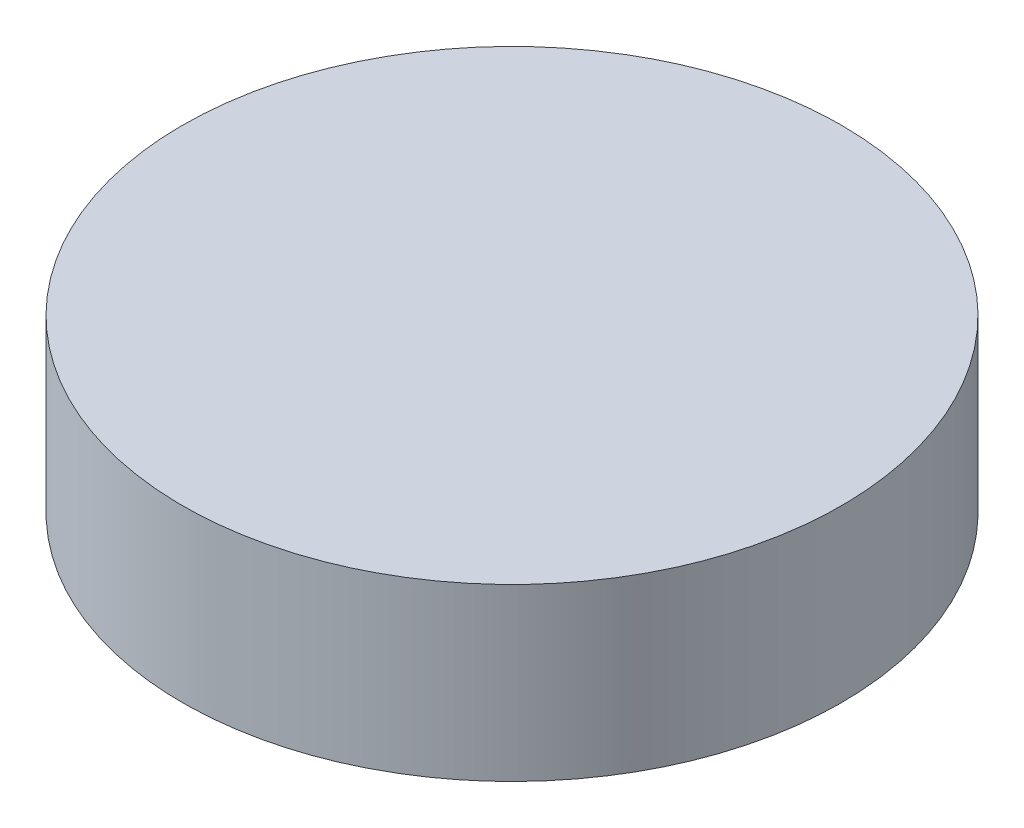
ISO-10303-21;
HEADER;
FILE_DESCRIPTION(('STEP AP214'),'2;1');
FILE_NAME('part.step','',(''),(''),'','','');
FILE_SCHEMA(('AUTOMOTIVE_DESIGN { 1 0 10303 214 1 1 1 1 }'));
ENDSEC;
DATA;
#1=APPLICATION_CONTEXT('core data for automotive mechanical design processes');
#2=APPLICATION_PROTOCOL_DEFINITION('international standard','automotive_design',2000,#1);
#3=PRODUCT_CONTEXT('',#1,'mechanical');
#4=PRODUCT('Part','Part','',(#3));
#5=PRODUCT_RELATED_PRODUCT_CATEGORY('part','',(#4));
#6=PRODUCT_DEFINITION_FORMATION('','',#4);
#7=PRODUCT_DEFINITION_CONTEXT('part definition',#1,'design');
#8=PRODUCT_DEFINITION('design','',#6,#7);
#9=PRODUCT_DEFINITION_SHAPE('','',#8);
#10=(LENGTH_UNIT() NAMED_UNIT(*) SI_UNIT(.MILLI.,.METRE.));
#11=(NAMED_UNIT(*) PLANE_ANGLE_UNIT() SI_UNIT($,.RADIAN.));
#12=(NAMED_UNIT(*) SI_UNIT($,.STERADIAN.) SOLID_ANGLE_UNIT());
#13=UNCERTAINTY_MEASURE_WITH_UNIT(LENGTH_MEASURE(1.E-05),#10,'distance_accuracy_value','');
#14=(GEOMETRIC_REPRESENTATION_CONTEXT(3) GLOBAL_UNCERTAINTY_ASSIGNED_CONTEXT((#13)) GLOBAL_UNIT_ASSIGNED_CONTEXT((#10,
#11,#12)) REPRESENTATION_CONTEXT('',''));
#15=CARTESIAN_POINT('',(0.,0.,0.));
#16=DIRECTION('',(0.,0.,1.));
#17=DIRECTION('',(1.,0.,0.));
#18=AXIS2_PLACEMENT_3D('',#15,#16,#17);
#19=CARTESIAN_POINT('',(-12.5,-12.9333687668426,-1.28535533905933));
#20=CARTESIAN_POINT('',(-12.3317700207924,-12.9333687668426,-1.28535533905933));
#21=CARTESIAN_POINT('',(-11.9953100623771,-12.9333687668426,-1.21842929220248));
#22=CARTESIAN_POINT('',(-11.5674545927316,-12.9333687668426,-0.932545407268426));
#23=CARTESIAN_POINT('',(-11.2815707077975,-12.9333687668426,-0.504689937622919));
#24=CARTESIAN_POINT('',(-11.1811816375122,-12.9333687668426,0.));
#25=CARTESIAN_POINT('',(-11.2815707077975,-12.9333687668426,0.504689937622919));
#26=CARTESIAN_POINT('',(-11.5674545927316,-12.9333687668426,0.932545407268426));
#27=CARTESIAN_POINT('',(-11.9953100623771,-12.9333687668426,1.21842929220248));
#28=CARTESIAN_POINT('',(-12.5,-12.9333687668426,1.31881836248775));
#29=CARTESIAN_POINT('',(-13.0046899376229,-12.9333687668426,1.21842929220248));
#30=CARTESIAN_POINT('',(-13.4325454072684,-12.9333687668426,0.932545407268426));
#31=CARTESIAN_POINT('',(-13.7184292922025,-12.9333687668426,0.50468993762292));
#32=CARTESIAN_POINT('',(-13.8188183624877,-12.9333687668426,0.));
#33=CARTESIAN_POINT('',(-13.7184292922025,-12.9333687668426,-0.504689937622919));
#34=CARTESIAN_POINT('',(-13.4325454072684,-12.9333687668426,-0.932545407268426));
#35=CARTESIAN_POINT('',(-13.0046899376229,-12.9333687668426,-1.21842929220248));
#36=CARTESIAN_POINT('',(-12.6682299792076,-12.9333687668426,-1.28535533905933));
#37=CARTESIAN_POINT('',(-12.5,-12.9333687668426,-1.28535533905933));
#38=B_SPLINE_CURVE_WITH_KNOTS('',3,(#19,#20,#21,#22,#23,#24,#25,#26,#27,#28,#29,#30,#31,#32,#33,
#34,#35,#36,#37),.UNSPECIFIED.,.T.,.F.,(4,1,1,1,1,1,1,1,1,1,1,1,1,1,1,1,4),(0.,
0.0625000000000001,0.125,0.1875,0.25,0.3125,0.375,0.4375,0.5,0.5625,0.625,0.6875,0.75,0.8125,
0.875,0.9375,1.),.UNSPECIFIED.);
#39=DIRECTION('',(0.,-1.,0.));
#40=VECTOR('',#39,1.);
#41=SURFACE_OF_LINEAR_EXTRUSION('',#38,#40);
#42=CARTESIAN_POINT('',(-12.5,-12.9333687668426,-1.28535533905933));
#43=CARTESIAN_POINT('',(-12.3317700207924,-12.9333687668426,-1.28535533905933));
#44=CARTESIAN_POINT('',(-11.9953100623771,-12.9333687668426,-1.21842929220248));
#45=CARTESIAN_POINT('',(-11.5674545927316,-12.9333687668426,-0.932545407268426));
#46=CARTESIAN_POINT('',(-11.2815707077975,-12.9333687668426,-0.504689937622919));
#47=CARTESIAN_POINT('',(-11.1811816375122,-12.9333687668426,0.));
#48=CARTESIAN_POINT('',(-11.2815707077975,-12.9333687668426,0.504689937622919));
#49=CARTESIAN_POINT('',(-11.5674545927316,-12.9333687668426,0.932545407268426));
#50=CARTESIAN_POINT('',(-11.9953100623771,-12.9333687668426,1.21842929220248));
#51=CARTESIAN_POINT('',(-12.5,-12.9333687668426,1.31881836248775));
#52=CARTESIAN_POINT('',(-13.0046899376229,-12.9333687668426,1.21842929220248));
#53=CARTESIAN_POINT('',(-13.4325454072684,-12.9333687668426,0.932545407268426));
#54=CARTESIAN_POINT('',(-13.7184292922025,-12.9333687668426,0.50468993762292));
#55=CARTESIAN_POINT('',(-13.8188183624877,-12.9333687668426,0.));
#56=CARTESIAN_POINT('',(-13.7184292922025,-12.9333687668426,-0.504689937622919));
#57=CARTESIAN_POINT('',(-13.4325454072684,-12.9333687668426,-0.932545407268426));
#58=CARTESIAN_POINT('',(-13.0046899376229,-12.9333687668426,-1.21842929220248));
#59=CARTESIAN_POINT('',(-12.6682299792076,-12.9333687668426,-1.28535533905933));
#60=CARTESIAN_POINT('',(-12.5,-12.9333687668426,-1.28535533905933));
#61=B_SPLINE_CURVE_WITH_KNOTS('',3,(#42,#43,#44,#45,#46,#47,#48,#49,#50,#51,#52,#53,#54,#55,#56,
#57,#58,#59,#60),.UNSPECIFIED.,.T.,.F.,(4,1,1,1,1,1,1,1,1,1,1,1,1,1,1,1,4),(0.,
0.0625000000000001,0.125,0.1875,0.25,0.3125,0.375,0.4375,0.5,0.5625,0.625,0.6875,0.75,0.8125,
0.875,0.9375,1.),.UNSPECIFIED.);
#62=CARTESIAN_POINT('',(-12.5,-12.9333687668426,-1.28535533905933));
#63=VERTEX_POINT('',#62);
#64=EDGE_CURVE('E9',#63,#63,#61,.T.);
#65=ORIENTED_EDGE('',*,*,#64,.T.);
#66=EDGE_LOOP('',(#65));
#67=FACE_BOUND('',#66,.T.);
#68=CARTESIAN_POINT('',(-12.5,-13.599,-1.28535533905933));
#69=CARTESIAN_POINT('',(-12.5210292435893,-13.599,-1.28535535428354));
#70=CARTESIAN_POINT('',(-12.5420580506909,-13.599,-1.2848324564651));
#71=CARTESIAN_POINT('',(-12.5840656469514,-13.599,-1.28275095206051));
#72=CARTESIAN_POINT('',(-12.605044433095,-13.599,-1.28119228454248));
#73=CARTESIAN_POINT('',(-12.6469017924796,-13.599,-1.27704921828212));
#74=CARTESIAN_POINT('',(-12.6677803587443,-13.599,-1.2744647491513));
#75=CARTESIAN_POINT('',(-12.7093873858979,-13.599,-1.26828002178174));
#76=CARTESIAN_POINT('',(-12.7301158402734,-13.599,-1.26467971973334));
#77=CARTESIAN_POINT('',(-12.7713726611837,-13.599,-1.25647322848943));
#78=CARTESIAN_POINT('',(-12.7919010277185,-13.599,-1.25186703929392));
#79=CARTESIAN_POINT('',(-12.832707709252,-13.599,-1.24165865806837));
#80=CARTESIAN_POINT('',(-12.8529860349978,-13.599,-1.23605650900607));
#81=CARTESIAN_POINT('',(-12.8932426430212,-13.599,-1.22386610104828));
#82=CARTESIAN_POINT('',(-12.9132209457939,-13.599,-1.21727790985115));
#83=CARTESIAN_POINT('',(-12.9528275830444,-13.599,-1.20312529881931));
#84=CARTESIAN_POINT('',(-12.9724559380415,-13.599,-1.19556093643833));
#85=CARTESIAN_POINT('',(-13.0113124478785,-13.599,-1.17946604308371));
#86=CARTESIAN_POINT('',(-13.0305406027184,-13.599,-1.17093551211008));
#87=CARTESIAN_POINT('',(-13.06855413176,-13.599,-1.15293679752466));
#88=CARTESIAN_POINT('',(-13.0873394798451,-13.599,-1.14346855877762));
#89=CARTESIAN_POINT('',(-13.1244251203754,-13.599,-1.12362275852903));
#90=CARTESIAN_POINT('',(-13.1427253794428,-13.599,-1.11324513466535));
#91=CARTESIAN_POINT('',(-13.1787984767248,-13.599,-1.09160886850265));
#92=CARTESIAN_POINT('',(-13.1965712921558,-13.599,-1.08035018822159));
#93=CARTESIAN_POINT('',(-13.2315471338735,-13.599,-1.05698007794264));
#94=CARTESIAN_POINT('',(-13.2487501601601,-13.599,-1.04486864794475));
#95=CARTESIAN_POINT('',(-13.2825440403118,-13.599,-1.0198212922901));
#96=CARTESIAN_POINT('',(-13.2991349205488,-13.599,-1.00688540221767));
#97=CARTESIAN_POINT('',(-13.331662109414,-13.599,-0.980217396939715));
#98=CARTESIAN_POINT('',(-13.3475984628843,-13.599,-0.966485336436221));
#99=CARTESIAN_POINT('',(-13.3787742546724,-13.599,-0.938253224868504));
#100=CARTESIAN_POINT('',(-13.3940137339342,-13.599,-0.923753219032213));
#101=CARTESIAN_POINT('',(-13.4237532190322,-13.599,-0.894013733934155));
#102=CARTESIAN_POINT('',(-13.4382532248685,-13.599,-0.878774254672389));
#103=CARTESIAN_POINT('',(-13.4664853364362,-13.599,-0.847598462884291));
#104=CARTESIAN_POINT('',(-13.4802173969397,-13.599,-0.831662109414029));
#105=CARTESIAN_POINT('',(-13.5068854022177,-13.599,-0.799134920548772));
#106=CARTESIAN_POINT('',(-13.5198212922901,-13.599,-0.782544040311809));
#107=CARTESIAN_POINT('',(-13.5448686479447,-13.599,-0.748750160160128));
#108=CARTESIAN_POINT('',(-13.5569800779426,-13.599,-0.731547133873459));
#109=CARTESIAN_POINT('',(-13.5803501882216,-13.599,-0.696571292155848));
#110=CARTESIAN_POINT('',(-13.5916088685027,-13.599,-0.678798476724906));
#111=CARTESIAN_POINT('',(-13.6132451346653,-13.599,-0.642725379442669));
#112=CARTESIAN_POINT('',(-13.623622758529,-13.599,-0.624425120374889));
#113=CARTESIAN_POINT('',(-13.6434685587776,-13.599,-0.587339479845542));
#114=CARTESIAN_POINT('',(-13.6529367975248,-13.599,-0.568554131761774));
#115=CARTESIAN_POINT('',(-13.67093551211,-13.599,-0.530540602716617));
#116=CARTESIAN_POINT('',(-13.6794660430833,-13.599,-0.511312447871825));
#117=CARTESIAN_POINT('',(-13.6955609364387,-13.599,-0.472455938048209));
#118=CARTESIAN_POINT('',(-13.7031252988208,-13.599,-0.452827583069387));
#119=CARTESIAN_POINT('',(-13.7172779098496,-13.599,-0.413220945768882));
#120=CARTESIAN_POINT('',(-13.7238661010426,-13.599,-0.39324264292792));
#121=CARTESIAN_POINT('',(-13.7360565090117,-13.599,-0.352986035091083));
#122=CARTESIAN_POINT('',(-13.7416586580894,-13.599,-0.332707709600189));
#123=CARTESIAN_POINT('',(-13.7518670392729,-13.599,-0.291901027370323));
#124=CARTESIAN_POINT('',(-13.7564732284109,-13.599,-0.271372659884375));
#125=CARTESIAN_POINT('',(-13.7646797198118,-13.599,-0.230115841572818));
#126=CARTESIAN_POINT('',(-13.7682800220747,-13.599,-0.209387390747211));
#127=CARTESIAN_POINT('',(-13.7744647488584,-13.599,-0.167780353895161));
#128=CARTESIAN_POINT('',(-13.7770492171889,-13.599,-0.146901774382847));
#129=CARTESIAN_POINT('',(-13.7811922856357,-13.599,-0.10504445119053));
#130=CARTESIAN_POINT('',(-13.7827509561402,-13.599,-0.0840657144826372));
#131=CARTESIAN_POINT('',(-13.7848324523857,-13.599,-0.0420579831636655));
#132=CARTESIAN_POINT('',(-13.7853553390593,-13.599,-0.0210289915818326));
#133=CARTESIAN_POINT('',(-13.7853553390593,-13.599,0.0210289915818331));
#134=CARTESIAN_POINT('',(-13.7848324523857,-13.599,0.0420579831636659));
#135=CARTESIAN_POINT('',(-13.7827509561402,-13.599,0.0840657144826377));
#136=CARTESIAN_POINT('',(-13.7811922856357,-13.599,0.10504445119053));
#137=CARTESIAN_POINT('',(-13.7770492171889,-13.599,0.146901774382848));
#138=CARTESIAN_POINT('',(-13.7744647488584,-13.599,0.167780353895162));
#139=CARTESIAN_POINT('',(-13.7682800220747,-13.599,0.209387390747211));
#140=CARTESIAN_POINT('',(-13.7646797198118,-13.599,0.230115841572819));
#141=CARTESIAN_POINT('',(-13.7564732284109,-13.599,0.271372659884376));
#142=CARTESIAN_POINT('',(-13.7518670392729,-13.599,0.291901027370324));
#143=CARTESIAN_POINT('',(-13.7416586580894,-13.599,0.33270770960019));
#144=CARTESIAN_POINT('',(-13.7360565090117,-13.599,0.352986035091084));
#145=CARTESIAN_POINT('',(-13.7238661010426,-13.599,0.393242642927921));
#146=CARTESIAN_POINT('',(-13.7172779098496,-13.599,0.413220945768883));
#147=CARTESIAN_POINT('',(-13.7031252988208,-13.599,0.452827583069388));
#148=CARTESIAN_POINT('',(-13.6955609364387,-13.599,0.472455938048211));
#149=CARTESIAN_POINT('',(-13.6794660430833,-13.599,0.511312447871826));
#150=CARTESIAN_POINT('',(-13.67093551211,-13.599,0.530540602716618));
#151=CARTESIAN_POINT('',(-13.6529367975248,-13.599,0.568554131761775));
#152=CARTESIAN_POINT('',(-13.6434685587776,-13.599,0.587339479845544));
#153=CARTESIAN_POINT('',(-13.623622758529,-13.599,0.624425120374891));
#154=CARTESIAN_POINT('',(-13.6132451346653,-13.599,0.64272537944267));
#155=CARTESIAN_POINT('',(-13.5916088685027,-13.599,0.678798476724906));
#156=CARTESIAN_POINT('',(-13.5803501882216,-13.599,0.69657129215585));
#157=CARTESIAN_POINT('',(-13.5569800779426,-13.599,0.731547133873461));
#158=CARTESIAN_POINT('',(-13.5448686479447,-13.599,0.748750160160129));
#159=CARTESIAN_POINT('',(-13.5198212922901,-13.599,0.78254404031181));
#160=CARTESIAN_POINT('',(-13.5068854022177,-13.599,0.799134920548773));
#161=CARTESIAN_POINT('',(-13.4802173969397,-13.599,0.83166210941403));
#162=CARTESIAN_POINT('',(-13.4664853364362,-13.599,0.847598462884291));
#163=CARTESIAN_POINT('',(-13.4382532248685,-13.599,0.87877425467239));
#164=CARTESIAN_POINT('',(-13.4237532190322,-13.599,0.894013733934156));
#165=CARTESIAN_POINT('',(-13.3940137339342,-13.599,0.923753219032213));
#166=CARTESIAN_POINT('',(-13.3787742546724,-13.599,0.938253224868505));
#167=CARTESIAN_POINT('',(-13.3475984628843,-13.599,0.966485336436221));
#168=CARTESIAN_POINT('',(-13.331662109414,-13.599,0.980217396939716));
#169=CARTESIAN_POINT('',(-13.2991349205488,-13.599,1.00688540221767));
#170=CARTESIAN_POINT('',(-13.2825440403118,-13.599,1.0198212922901));
#171=CARTESIAN_POINT('',(-13.2487501601601,-13.599,1.04486864794475));
#172=CARTESIAN_POINT('',(-13.2315471338735,-13.599,1.05698007794264));
#173=CARTESIAN_POINT('',(-13.1965712921558,-13.599,1.08035018822159));
#174=CARTESIAN_POINT('',(-13.1787984767249,-13.599,1.09160886850266));
#175=CARTESIAN_POINT('',(-13.1427253794427,-13.599,1.11324513466535));
#176=CARTESIAN_POINT('',(-13.1244251203749,-13.599,1.12362275852901));
#177=CARTESIAN_POINT('',(-13.0873394798455,-13.599,1.14346855877765));
#178=CARTESIAN_POINT('',(-13.0685541317618,-13.599,1.15293679752477));
#179=CARTESIAN_POINT('',(-13.0305406027166,-13.599,1.17093551210997));
#180=CARTESIAN_POINT('',(-13.0113124478718,-13.599,1.17946604308331));
#181=CARTESIAN_POINT('',(-12.9724559380482,-13.599,1.19556093643873));
#182=CARTESIAN_POINT('',(-12.9528275830694,-13.599,1.20312529882082));
#183=CARTESIAN_POINT('',(-12.9132209457689,-13.599,1.21727790984964));
#184=CARTESIAN_POINT('',(-12.8932426429279,-13.599,1.22386610104265));
#185=CARTESIAN_POINT('',(-12.8529860350911,-13.599,1.23605650901171));
#186=CARTESIAN_POINT('',(-12.8327077096002,-13.599,1.24165865808941));
#187=CARTESIAN_POINT('',(-12.7919010273703,-13.599,1.25186703927288));
#188=CARTESIAN_POINT('',(-12.7713726598844,-13.599,1.25647322841093));
#189=CARTESIAN_POINT('',(-12.7301158415728,-13.599,1.26467971981183));
#190=CARTESIAN_POINT('',(-12.7093873907472,-13.599,1.26828002207469));
#191=CARTESIAN_POINT('',(-12.6677803538952,-13.599,1.27446474885836));
#192=CARTESIAN_POINT('',(-12.6469017743828,-13.599,1.27704921718887));
#193=CARTESIAN_POINT('',(-12.6050444511905,-13.599,1.28119228563567));
#194=CARTESIAN_POINT('',(-12.5840657144826,-13.599,1.28275095614019));
#195=CARTESIAN_POINT('',(-12.5420579831637,-13.599,1.28483245238567));
#196=CARTESIAN_POINT('',(-12.5210289915818,-13.599,1.28535533905933));
#197=CARTESIAN_POINT('',(-12.4789710084182,-13.599,1.28535533905933));
#198=CARTESIAN_POINT('',(-12.4579420168363,-13.599,1.28483245238567));
#199=CARTESIAN_POINT('',(-12.4159342855174,-13.599,1.28275095614019));
#200=CARTESIAN_POINT('',(-12.3949555488095,-13.599,1.28119228563567));
#201=CARTESIAN_POINT('',(-12.3530982256172,-13.599,1.27704921718887));
#202=CARTESIAN_POINT('',(-12.3322196461048,-13.599,1.27446474885836));
#203=CARTESIAN_POINT('',(-12.2906126092528,-13.599,1.26828002207469));
#204=CARTESIAN_POINT('',(-12.2698841584272,-13.599,1.26467971981183));
#205=CARTESIAN_POINT('',(-12.2286273401156,-13.599,1.25647322841093));
#206=CARTESIAN_POINT('',(-12.2080989726297,-13.599,1.25186703927288));
#207=CARTESIAN_POINT('',(-12.1672922903998,-13.599,1.24165865808941));
#208=CARTESIAN_POINT('',(-12.1470139649089,-13.599,1.23605650901171));
#209=CARTESIAN_POINT('',(-12.1067573570721,-13.599,1.22386610104265));
#210=CARTESIAN_POINT('',(-12.0867790542311,-13.599,1.21727790984964));
#211=CARTESIAN_POINT('',(-12.0471724169306,-13.599,1.20312529882082));
#212=CARTESIAN_POINT('',(-12.0275440619518,-13.599,1.19556093643873));
#213=CARTESIAN_POINT('',(-11.9886875521282,-13.599,1.17946604308331));
#214=CARTESIAN_POINT('',(-11.9694593972834,-13.599,1.17093551210997));
#215=CARTESIAN_POINT('',(-11.9314458682382,-13.599,1.15293679752477));
#216=CARTESIAN_POINT('',(-11.9126605201545,-13.599,1.14346855877765));
#217=CARTESIAN_POINT('',(-11.8755748796251,-13.599,1.123622758529));
#218=CARTESIAN_POINT('',(-11.8572746205573,-13.599,1.11324513466535));
#219=CARTESIAN_POINT('',(-11.8212015232751,-13.599,1.09160886850266));
#220=CARTESIAN_POINT('',(-11.8034287078441,-13.599,1.08035018822159));
#221=CARTESIAN_POINT('',(-11.7684528661265,-13.599,1.05698007794264));
#222=CARTESIAN_POINT('',(-11.7512498398399,-13.599,1.04486864794475));
#223=CARTESIAN_POINT('',(-11.7174559596882,-13.599,1.0198212922901));
#224=CARTESIAN_POINT('',(-11.7008650794512,-13.599,1.00688540221767));
#225=CARTESIAN_POINT('',(-11.668337890586,-13.599,0.980217396939715));
#226=CARTESIAN_POINT('',(-11.6524015371157,-13.599,0.966485336436221));
#227=CARTESIAN_POINT('',(-11.6212257453276,-13.599,0.938253224868504));
#228=CARTESIAN_POINT('',(-11.6059862660658,-13.599,0.923753219032213));
#229=CARTESIAN_POINT('',(-11.5762467809678,-13.599,0.894013733934155));
#230=CARTESIAN_POINT('',(-11.5617467751315,-13.599,0.878774254672389));
#231=CARTESIAN_POINT('',(-11.5335146635638,-13.599,0.84759846288429));
#232=CARTESIAN_POINT('',(-11.5197826030603,-13.599,0.831662109414029));
#233=CARTESIAN_POINT('',(-11.4931145977823,-13.599,0.799134920548772));
#234=CARTESIAN_POINT('',(-11.4801787077099,-13.599,0.782544040311809));
#235=CARTESIAN_POINT('',(-11.4551313520553,-13.599,0.748750160160128));
#236=CARTESIAN_POINT('',(-11.4430199220574,-13.599,0.73154713387346));
#237=CARTESIAN_POINT('',(-11.4196498117784,-13.599,0.696571292155849));
#238=CARTESIAN_POINT('',(-11.4083911314973,-13.599,0.678798476724905));
#239=CARTESIAN_POINT('',(-11.3867548653347,-13.599,0.642725379442669));
#240=CARTESIAN_POINT('',(-11.376377241471,-13.599,0.62442512037489));
#241=CARTESIAN_POINT('',(-11.3565314412223,-13.599,0.587339479845543));
#242=CARTESIAN_POINT('',(-11.3470632024752,-13.599,0.568554131761774));
#243=CARTESIAN_POINT('',(-11.32906448789,-13.599,0.530540602716617));
#244=CARTESIAN_POINT('',(-11.3205339569167,-13.599,0.511312447871824));
#245=CARTESIAN_POINT('',(-11.3044390635613,-13.599,0.472455938048209));
#246=CARTESIAN_POINT('',(-11.2968747011792,-13.599,0.452827583069387));
#247=CARTESIAN_POINT('',(-11.2827220901504,-13.599,0.413220945768882));
#248=CARTESIAN_POINT('',(-11.2761338989574,-13.599,0.39324264292792));
#249=CARTESIAN_POINT('',(-11.2639434909883,-13.599,0.352986035091083));
#250=CARTESIAN_POINT('',(-11.2583413419106,-13.599,0.332707709600189));
#251=CARTESIAN_POINT('',(-11.2481329607271,-13.599,0.291901027370323));
#252=CARTESIAN_POINT('',(-11.2435267715891,-13.599,0.271372659884375));
#253=CARTESIAN_POINT('',(-11.2353202801882,-13.599,0.230115841572818));
#254=CARTESIAN_POINT('',(-11.2317199779253,-13.599,0.209387390747211));
#255=CARTESIAN_POINT('',(-11.2255352511416,-13.599,0.167780353895161));
#256=CARTESIAN_POINT('',(-11.2229507828111,-13.599,0.146901774382847));
#257=CARTESIAN_POINT('',(-11.2188077143643,-13.599,0.105044451190529));
#258=CARTESIAN_POINT('',(-11.2172490438598,-13.599,0.0840657144826369));
#259=CARTESIAN_POINT('',(-11.2151675476143,-13.599,0.0420579831636654));
#260=CARTESIAN_POINT('',(-11.2146446609407,-13.599,0.0210289915818325));
#261=CARTESIAN_POINT('',(-11.2146446609407,-13.599,-0.0210289915818333));
#262=CARTESIAN_POINT('',(-11.2151675476143,-13.599,-0.0420579831636662));
#263=CARTESIAN_POINT('',(-11.2172490438598,-13.599,-0.0840657144826378));
#264=CARTESIAN_POINT('',(-11.2188077143643,-13.599,-0.10504445119053));
#265=CARTESIAN_POINT('',(-11.2229507828111,-13.599,-0.146901774382848));
#266=CARTESIAN_POINT('',(-11.2255352511416,-13.599,-0.167780353895162));
#267=CARTESIAN_POINT('',(-11.2317199779253,-13.599,-0.209387390747211));
#268=CARTESIAN_POINT('',(-11.2353202801882,-13.599,-0.230115841572819));
#269=CARTESIAN_POINT('',(-11.2435267715891,-13.599,-0.271372659884375));
#270=CARTESIAN_POINT('',(-11.2481329607271,-13.599,-0.291901027370323));
#271=CARTESIAN_POINT('',(-11.2583413419106,-13.599,-0.33270770960019));
#272=CARTESIAN_POINT('',(-11.2639434909883,-13.599,-0.352986035091083));
#273=CARTESIAN_POINT('',(-11.2761338989574,-13.599,-0.393242642927921));
#274=CARTESIAN_POINT('',(-11.2827220901504,-13.599,-0.413220945768883));
#275=CARTESIAN_POINT('',(-11.2968747011792,-13.599,-0.452827583069388));
#276=CARTESIAN_POINT('',(-11.3044390635613,-13.599,-0.47245593804821));
#277=CARTESIAN_POINT('',(-11.3205339569167,-13.599,-0.511312447871825));
#278=CARTESIAN_POINT('',(-11.32906448789,-13.599,-0.530540602716618));
#279=CARTESIAN_POINT('',(-11.3470632024752,-13.599,-0.568554131761775));
#280=CARTESIAN_POINT('',(-11.3565314412223,-13.599,-0.587339479845543));
#281=CARTESIAN_POINT('',(-11.376377241471,-13.599,-0.62442512037489));
#282=CARTESIAN_POINT('',(-11.3867548653347,-13.599,-0.642725379442669));
#283=CARTESIAN_POINT('',(-11.4083911314973,-13.599,-0.678798476724906));
#284=CARTESIAN_POINT('',(-11.4196498117784,-13.599,-0.696571292155849));
#285=CARTESIAN_POINT('',(-11.4430199220574,-13.599,-0.73154713387346));
#286=CARTESIAN_POINT('',(-11.4551313520553,-13.599,-0.748750160160128));
#287=CARTESIAN_POINT('',(-11.4801787077099,-13.599,-0.782544040311809));
#288=CARTESIAN_POINT('',(-11.4931145977823,-13.599,-0.799134920548772));
#289=CARTESIAN_POINT('',(-11.5197826030603,-13.599,-0.831662109414029));
#290=CARTESIAN_POINT('',(-11.5335146635638,-13.599,-0.847598462884291));
#291=CARTESIAN_POINT('',(-11.5617467751315,-13.599,-0.878774254672389));
#292=CARTESIAN_POINT('',(-11.5762467809678,-13.599,-0.894013733934155));
#293=CARTESIAN_POINT('',(-11.6059862660658,-13.599,-0.923753219032213));
#294=CARTESIAN_POINT('',(-11.6212257453276,-13.599,-0.938253224868505));
#295=CARTESIAN_POINT('',(-11.6524015371157,-13.599,-0.966485336436221));
#296=CARTESIAN_POINT('',(-11.668337890586,-13.599,-0.980217396939716));
#297=CARTESIAN_POINT('',(-11.7008650794512,-13.599,-1.00688540221767));
#298=CARTESIAN_POINT('',(-11.7174559596882,-13.599,-1.0198212922901));
#299=CARTESIAN_POINT('',(-11.7512498398399,-13.599,-1.04486864794475));
#300=CARTESIAN_POINT('',(-11.7684528661265,-13.599,-1.05698007794264));
#301=CARTESIAN_POINT('',(-11.8034287078442,-13.599,-1.08035018822159));
#302=CARTESIAN_POINT('',(-11.8212015232752,-13.599,-1.09160886850265));
#303=CARTESIAN_POINT('',(-11.8572746205572,-13.599,-1.11324513466535));
#304=CARTESIAN_POINT('',(-11.8755748796246,-13.599,-1.12362275852903));
#305=CARTESIAN_POINT('',(-11.9126605201549,-13.599,-1.14346855877762));
#306=CARTESIAN_POINT('',(-11.93144586824,-13.599,-1.15293679752466));
#307=CARTESIAN_POINT('',(-11.9694593972816,-13.599,-1.17093551211008));
#308=CARTESIAN_POINT('',(-11.9886875521215,-13.599,-1.17946604308371));
#309=CARTESIAN_POINT('',(-12.0275440619585,-13.599,-1.19556093643833));
#310=CARTESIAN_POINT('',(-12.0471724169556,-13.599,-1.20312529881931));
#311=CARTESIAN_POINT('',(-12.0867790542061,-13.599,-1.21727790985115));
#312=CARTESIAN_POINT('',(-12.1067573569788,-13.599,-1.22386610104828));
#313=CARTESIAN_POINT('',(-12.1470139650022,-13.599,-1.23605650900607));
#314=CARTESIAN_POINT('',(-12.167292290748,-13.599,-1.24165865806837));
#315=CARTESIAN_POINT('',(-12.2080989722815,-13.599,-1.25186703929392));
#316=CARTESIAN_POINT('',(-12.2286273388163,-13.599,-1.25647322848943));
#317=CARTESIAN_POINT('',(-12.2698841597265,-13.599,-1.26467971973334));
#318=CARTESIAN_POINT('',(-12.2906126141021,-13.599,-1.26828002178174));
#319=CARTESIAN_POINT('',(-12.3322196412557,-13.599,-1.2744647491513));
#320=CARTESIAN_POINT('',(-12.3530982075204,-13.599,-1.27704921828212));
#321=CARTESIAN_POINT('',(-12.394955566905,-13.599,-1.28119228454249));
#322=CARTESIAN_POINT('',(-12.4159343530485,-13.599,-1.28275095206051));
#323=CARTESIAN_POINT('',(-12.4579419493091,-13.599,-1.2848324564651));
#324=CARTESIAN_POINT('',(-12.4789707564107,-13.599,-1.28535535428354));
#325=CARTESIAN_POINT('',(-12.5,-13.599,-1.28535533905933));
#326=B_SPLINE_CURVE_WITH_KNOTS('',3,(#68,#69,#70,#71,#72,#73,#74,#75,#76,#77,#78,#79,#80,#81,
#82,#83,#84,#85,#86,#87,#88,#89,#90,#91,#92,#93,#94,#95,#96,#97,#98,#99,#100,#101,#102,#103,
#104,#105,#106,#107,#108,#109,#110,#111,#112,#113,#114,#115,#116,#117,#118,#119,#120,#121,#122,
#123,#124,#125,#126,#127,#128,#129,#130,#131,#132,#133,#134,#135,#136,#137,#138,#139,#140,#141,
#142,#143,#144,#145,#146,#147,#148,#149,#150,#151,#152,#153,#154,#155,#156,#157,#158,#159,#160,
#161,#162,#163,#164,#165,#166,#167,#168,#169,#170,#171,#172,#173,#174,#175,#176,#177,#178,#179,
#180,#181,#182,#183,#184,#185,#186,#187,#188,#189,#190,#191,#192,#193,#194,#195,#196,#197,#198,
#199,#200,#201,#202,#203,#204,#205,#206,#207,#208,#209,#210,#211,#212,#213,#214,#215,#216,#217,
#218,#219,#220,#221,#222,#223,#224,#225,#226,#227,#228,#229,#230,#231,#232,#233,#234,#235,#236,
#237,#238,#239,#240,#241,#242,#243,#244,#245,#246,#247,#248,#249,#250,#251,#252,#253,#254,#255,
#256,#257,#258,#259,#260,#261,#262,#263,#264,#265,#266,#267,#268,#269,#270,#271,#272,#273,#274,
#275,#276,#277,#278,#279,#280,#281,#282,#283,#284,#285,#286,#287,#288,#289,#290,#291,#292,#293,
#294,#295,#296,#297,#298,#299,#300,#301,#302,#303,#304,#305,#306,#307,#308,#309,#310,#311,#312,
#313,#314,#315,#316,#317,#318,#319,#320,#321,#322,#323,#324,#325),.UNSPECIFIED.,.F.,.F.,(4,2,2,
2,2,2,2,2,2,2,2,2,2,2,2,2,2,2,2,2,2,2,2,2,2,2,2,2,2,2,2,2,2,2,2,2,2,2,2,2,2,2,2,2,2,2,2,2,2,2,2,
2,2,2,2,2,2,2,2,2,2,2,2,2,2,2,2,2,2,2,2,2,2,2,2,2,2,2,2,2,2,2,2,2,2,2,2,2,2,2,2,2,2,2,2,2,2,2,2,
2,2,2,2,2,2,2,2,2,2,2,2,2,2,2,2,2,2,2,2,2,2,2,2,2,2,2,2,2,4),(0.,0.0630806127990758,
0.12616493680959,0.189253590290848,0.252344965001654,0.315436339712461,0.378524993193721,
0.441609317204232,0.504689930003312,0.567770542802388,0.6308548668129,0.693943520294158,
0.757034895004962,0.82012626971577,0.883214923197029,0.946299247207541,1.00937986000662,
1.0724604728057,1.13554479681621,1.19863345029747,1.26172482500827,1.32481619971908,
1.38790485320034,1.45098917721085,1.51406979000993,1.57715040280901,1.64023472681952,
1.70332338030078,1.76641475501158,1.82950612972239,1.89259478320365,1.95567910721416,
2.01875972001324,2.08184033281232,2.14492465682283,2.20801331030409,2.27110468501489,
2.3341960597257,2.39728471320696,2.46036903721747,2.52344965001655,2.58653026281563,
2.64961458682614,2.7127032403074,2.7757946150182,2.83888598972901,2.90197464321027,
2.96505896722078,3.02813958001986,3.09122019281893,3.15430451682944,3.2173931703107,
3.28048454502151,3.34357591973231,3.40666457321357,3.46974889722409,3.53282951002316,
3.59591012282224,3.65899444683275,3.72208310031401,3.78517447502482,3.84826584973563,
3.91135450321688,3.9744388272274,4.03751944002647,4.10060005282555,4.16368437683606,
4.22677303031732,4.28986440502813,4.35295577973894,4.4160444332202,4.47912875723071,
4.54220937002979,4.60528998282887,4.66837430683938,4.73146296032063,4.79455433503144,
4.85764570974225,4.9207343632235,4.98381868723402,5.04689930003309,5.10997991283217,
5.17306423684268,5.23615289032394,5.29924426503475,5.36233563974555,5.42542429322681,
5.48850861723732,5.5515892300364,5.61466984283548,5.67775416684599,5.74084282032725,
5.80393419503806,5.86702556974886,5.93011422323012,5.99319854724063,6.05627916003971,
6.11935977283879,6.1824440968493,6.24553275033056,6.30862412504136,6.37171549975217,
6.43480415323343,6.49788847724394,6.56096909004302,6.6240497028421,6.68713402685261,
6.75022268033387,6.81331405504467,6.87640542975548,6.93949408323674,7.00257840724725,
7.06565902004633,7.12873963284541,7.19182395685592,7.25491261033718,7.31800398504799,
7.38109535975879,7.44418401324005,7.50726833725056,7.57034895004964,7.63342956284872,
7.69651388685923,7.75960254034049,7.82269391505129,7.8857852897621,7.94887394324336,
8.01195826725387,8.07503888005295),.UNSPECIFIED.);
#327=CARTESIAN_POINT('',(-12.5,-13.599,-1.28535533905933));
#328=VERTEX_POINT('',#327);
#329=EDGE_CURVE('E24',#328,#328,#326,.F.);
#330=ORIENTED_EDGE('',*,*,#329,.F.);
#331=EDGE_LOOP('',(#330));
#332=FACE_BOUND('',#331,.T.);
#333=ADVANCED_FACE('F14',(#67,#332),#41,.T.);
#334=CARTESIAN_POINT('',(-3.5,-12.9333687668426,0.));
#335=DIRECTION('',(0.,-1.,0.));
#336=DIRECTION('',(1.,0.,0.));
#337=AXIS2_PLACEMENT_3D('',#334,#335,#336);
#338=PLANE('',#337);
#339=ORIENTED_EDGE('',*,*,#64,.F.);
#340=EDGE_LOOP('',(#339));
#341=FACE_BOUND('',#340,.T.);
#342=ADVANCED_FACE('F62',(#341),#338,.F.);
#343=CARTESIAN_POINT('',(-3.5,-13.599,0.));
#344=DIRECTION('',(0.,-1.,0.));
#345=DIRECTION('',(1.,0.,0.));
#346=AXIS2_PLACEMENT_3D('',#343,#344,#345);
#347=PLANE('',#346);
#348=ORIENTED_EDGE('',*,*,#329,.T.);
#349=EDGE_LOOP('',(#348));
#350=FACE_BOUND('',#349,.T.);
#351=ADVANCED_FACE('F31',(#350),#347,.T.);
#352=CLOSED_SHELL('',(#333,#342,#351));
#353=MANIFOLD_SOLID_BREP('B1',#352);
#354=ADVANCED_BREP_SHAPE_REPRESENTATION('',(#18,#353),#14);
#355=SHAPE_DEFINITION_REPRESENTATION(#9,#354);
ENDSEC;
END-ISO-10303-21;
